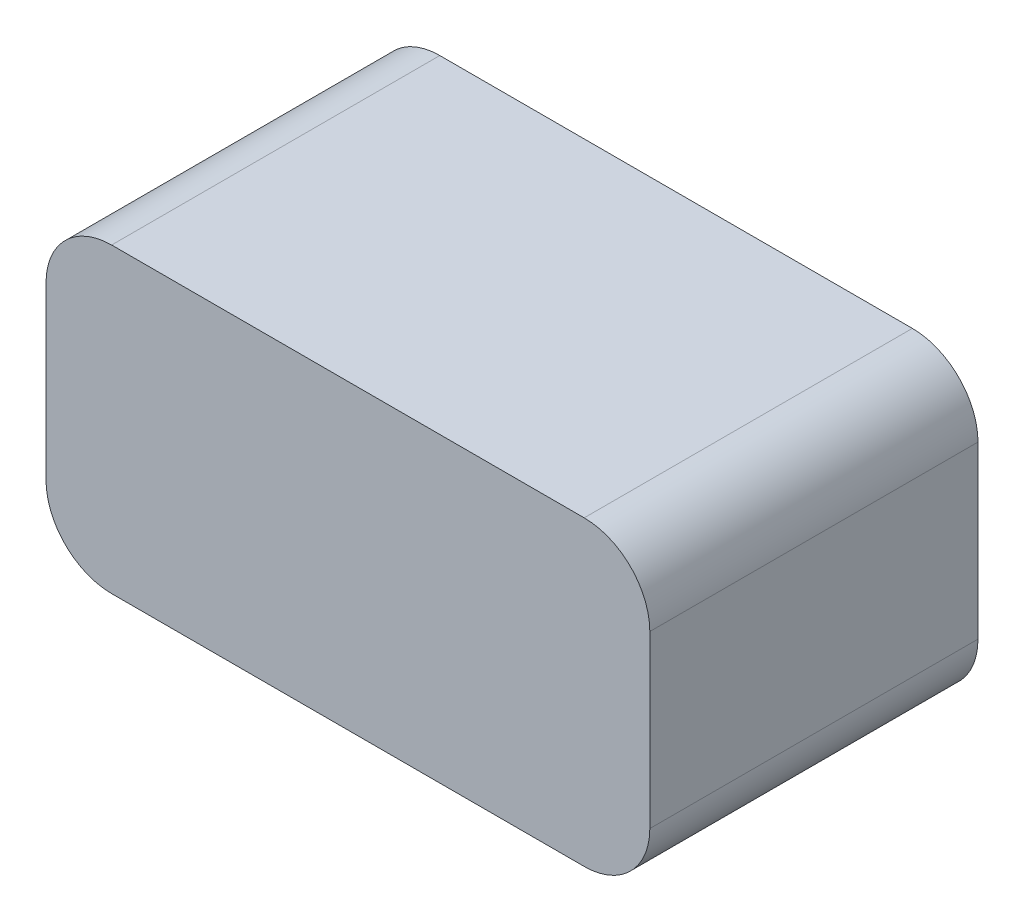
ISO-10303-21;
HEADER;
FILE_DESCRIPTION(('STEP AP214'),'2;1');
FILE_NAME('part.step','',(''),(''),'','','');
FILE_SCHEMA(('AUTOMOTIVE_DESIGN { 1 0 10303 214 1 1 1 1 }'));
ENDSEC;
DATA;
#1=APPLICATION_CONTEXT('core data for automotive mechanical design processes');
#2=APPLICATION_PROTOCOL_DEFINITION('international standard','automotive_design',2000,#1);
#3=PRODUCT_CONTEXT('',#1,'mechanical');
#4=PRODUCT('Part','Part','',(#3));
#5=PRODUCT_RELATED_PRODUCT_CATEGORY('part','',(#4));
#6=PRODUCT_DEFINITION_FORMATION('','',#4);
#7=PRODUCT_DEFINITION_CONTEXT('part definition',#1,'design');
#8=PRODUCT_DEFINITION('design','',#6,#7);
#9=PRODUCT_DEFINITION_SHAPE('','',#8);
#10=(LENGTH_UNIT() NAMED_UNIT(*) SI_UNIT(.MILLI.,.METRE.));
#11=(NAMED_UNIT(*) PLANE_ANGLE_UNIT() SI_UNIT($,.RADIAN.));
#12=(NAMED_UNIT(*) SI_UNIT($,.STERADIAN.) SOLID_ANGLE_UNIT());
#13=UNCERTAINTY_MEASURE_WITH_UNIT(LENGTH_MEASURE(1.E-05),#10,'distance_accuracy_value','');
#14=(GEOMETRIC_REPRESENTATION_CONTEXT(3) GLOBAL_UNCERTAINTY_ASSIGNED_CONTEXT((#13)) GLOBAL_UNIT_ASSIGNED_CONTEXT((#10,
#11,#12)) REPRESENTATION_CONTEXT('',''));
#15=CARTESIAN_POINT('',(0.,0.,0.));
#16=DIRECTION('',(0.,0.,1.));
#17=DIRECTION('',(1.,0.,0.));
#18=AXIS2_PLACEMENT_3D('',#15,#16,#17);
#19=CARTESIAN_POINT('',(0.,23.,0.));
#20=DIRECTION('',(1.,0.,0.));
#21=DIRECTION('',(0.,0.,-1.));
#22=AXIS2_PLACEMENT_3D('',#19,#20,#21);
#23=PLANE('',#22);
#24=DIRECTION('',(0.,-1.,0.));
#25=VECTOR('',#24,1.);
#26=CARTESIAN_POINT('',(0.,23.,-25.));
#27=LINE('',#26,#25);
#28=CARTESIAN_POINT('',(0.,18.,-25.));
#29=VERTEX_POINT('',#28);
#30=CARTESIAN_POINT('',(0.,5.,-25.));
#31=VERTEX_POINT('',#30);
#32=EDGE_CURVE('E191',#29,#31,#27,.T.);
#33=ORIENTED_EDGE('',*,*,#32,.T.);
#34=DIRECTION('',(0.,0.,1.));
#35=VECTOR('',#34,1.);
#36=CARTESIAN_POINT('',(0.,5.,0.));
#37=LINE('',#36,#35);
#38=CARTESIAN_POINT('',(0.,5.,0.));
#39=VERTEX_POINT('',#38);
#40=EDGE_CURVE('E130',#31,#39,#37,.T.);
#41=ORIENTED_EDGE('',*,*,#40,.T.);
#42=DIRECTION('',(0.,-1.,0.));
#43=VECTOR('',#42,1.);
#44=CARTESIAN_POINT('',(0.,23.,0.));
#45=LINE('',#44,#43);
#46=CARTESIAN_POINT('',(0.,18.,0.));
#47=VERTEX_POINT('',#46);
#48=EDGE_CURVE('E113',#47,#39,#45,.T.);
#49=ORIENTED_EDGE('',*,*,#48,.F.);
#50=DIRECTION('',(0.,0.,1.));
#51=VECTOR('',#50,1.);
#52=CARTESIAN_POINT('',(0.,18.,0.));
#53=LINE('',#52,#51);
#54=EDGE_CURVE('E127',#47,#29,#53,.F.);
#55=ORIENTED_EDGE('',*,*,#54,.T.);
#56=EDGE_LOOP('',(#33,#41,#49,#55));
#57=FACE_BOUND('',#56,.T.);
#58=ADVANCED_FACE('F43',(#57),#23,.F.);
#59=CARTESIAN_POINT('',(0.,23.,0.));
#60=DIRECTION('',(0.,0.,-1.));
#61=DIRECTION('',(-1.,0.,0.));
#62=AXIS2_PLACEMENT_3D('',#59,#60,#61);
#63=PLANE('',#62);
#64=ORIENTED_EDGE('',*,*,#48,.T.);
#65=CARTESIAN_POINT('',(5.,5.,0.));
#66=DIRECTION('',(0.,0.,-1.));
#67=DIRECTION('',(-1.,0.,0.));
#68=AXIS2_PLACEMENT_3D('',#65,#66,#67);
#69=CIRCLE('',#68,5.);
#70=CARTESIAN_POINT('',(5.,0.,0.));
#71=VERTEX_POINT('',#70);
#72=EDGE_CURVE('E121',#39,#71,#69,.F.);
#73=ORIENTED_EDGE('',*,*,#72,.T.);
#74=DIRECTION('',(1.,0.,0.));
#75=VECTOR('',#74,1.);
#76=CARTESIAN_POINT('',(0.,0.,0.));
#77=LINE('',#76,#75);
#78=CARTESIAN_POINT('',(41.,0.,0.));
#79=VERTEX_POINT('',#78);
#80=EDGE_CURVE('E199',#71,#79,#77,.T.);
#81=ORIENTED_EDGE('',*,*,#80,.T.);
#82=CARTESIAN_POINT('',(41.,5.,0.));
#83=DIRECTION('',(0.,0.,-1.));
#84=DIRECTION('',(-1.,0.,0.));
#85=AXIS2_PLACEMENT_3D('',#82,#83,#84);
#86=CIRCLE('',#85,5.);
#87=CARTESIAN_POINT('',(46.,5.,0.));
#88=VERTEX_POINT('',#87);
#89=EDGE_CURVE('E122',#79,#88,#86,.F.);
#90=ORIENTED_EDGE('',*,*,#89,.T.);
#91=DIRECTION('',(0.,-1.,0.));
#92=VECTOR('',#91,1.);
#93=CARTESIAN_POINT('',(46.,23.,0.));
#94=LINE('',#93,#92);
#95=CARTESIAN_POINT('',(46.,18.,0.));
#96=VERTEX_POINT('',#95);
#97=EDGE_CURVE('E132',#96,#88,#94,.T.);
#98=ORIENTED_EDGE('',*,*,#97,.F.);
#99=CARTESIAN_POINT('',(41.,18.,0.));
#100=DIRECTION('',(0.,0.,-1.));
#101=DIRECTION('',(-1.,0.,0.));
#102=AXIS2_PLACEMENT_3D('',#99,#100,#101);
#103=CIRCLE('',#102,5.);
#104=CARTESIAN_POINT('',(41.,23.,0.));
#105=VERTEX_POINT('',#104);
#106=EDGE_CURVE('E140',#96,#105,#103,.F.);
#107=ORIENTED_EDGE('',*,*,#106,.T.);
#108=DIRECTION('',(1.,0.,0.));
#109=VECTOR('',#108,1.);
#110=CARTESIAN_POINT('',(0.,23.,0.));
#111=LINE('',#110,#109);
#112=CARTESIAN_POINT('',(5.,23.,0.));
#113=VERTEX_POINT('',#112);
#114=EDGE_CURVE('E115',#113,#105,#111,.T.);
#115=ORIENTED_EDGE('',*,*,#114,.F.);
#116=CARTESIAN_POINT('',(5.,18.,0.));
#117=DIRECTION('',(0.,0.,-1.));
#118=DIRECTION('',(-1.,0.,0.));
#119=AXIS2_PLACEMENT_3D('',#116,#117,#118);
#120=CIRCLE('',#119,5.);
#121=EDGE_CURVE('E110',#113,#47,#120,.F.);
#122=ORIENTED_EDGE('',*,*,#121,.T.);
#123=EDGE_LOOP('',(#64,#73,#81,#90,#98,#107,#115,#122));
#124=FACE_BOUND('',#123,.T.);
#125=ADVANCED_FACE('F112',(#124),#63,.F.);
#126=CARTESIAN_POINT('',(46.,23.,0.));
#127=DIRECTION('',(-1.,0.,0.));
#128=DIRECTION('',(0.,0.,1.));
#129=AXIS2_PLACEMENT_3D('',#126,#127,#128);
#130=PLANE('',#129);
#131=ORIENTED_EDGE('',*,*,#97,.T.);
#132=DIRECTION('',(0.,0.,-1.));
#133=VECTOR('',#132,1.);
#134=CARTESIAN_POINT('',(46.,5.,-25.));
#135=LINE('',#134,#133);
#136=CARTESIAN_POINT('',(46.,5.,-25.));
#137=VERTEX_POINT('',#136);
#138=EDGE_CURVE('E11',#88,#137,#135,.T.);
#139=ORIENTED_EDGE('',*,*,#138,.T.);
#140=DIRECTION('',(0.,-1.,0.));
#141=VECTOR('',#140,1.);
#142=CARTESIAN_POINT('',(46.,23.,-25.));
#143=LINE('',#142,#141);
#144=CARTESIAN_POINT('',(46.,18.,-25.));
#145=VERTEX_POINT('',#144);
#146=EDGE_CURVE('E177',#145,#137,#143,.T.);
#147=ORIENTED_EDGE('',*,*,#146,.F.);
#148=DIRECTION('',(0.,0.,-1.));
#149=VECTOR('',#148,1.);
#150=CARTESIAN_POINT('',(46.,18.,0.));
#151=LINE('',#150,#149);
#152=EDGE_CURVE('E52',#145,#96,#151,.F.);
#153=ORIENTED_EDGE('',*,*,#152,.T.);
#154=EDGE_LOOP('',(#131,#139,#147,#153));
#155=FACE_BOUND('',#154,.T.);
#156=ADVANCED_FACE('F176',(#155),#130,.F.);
#157=CARTESIAN_POINT('',(0.,23.,-25.));
#158=DIRECTION('',(0.,0.,1.));
#159=DIRECTION('',(1.,0.,0.));
#160=AXIS2_PLACEMENT_3D('',#157,#158,#159);
#161=PLANE('',#160);
#162=DIRECTION('',(-1.,0.,0.));
#163=VECTOR('',#162,1.);
#164=CARTESIAN_POINT('',(0.,0.,-25.));
#165=LINE('',#164,#163);
#166=CARTESIAN_POINT('',(41.,0.,-25.));
#167=VERTEX_POINT('',#166);
#168=CARTESIAN_POINT('',(5.,0.,-25.));
#169=VERTEX_POINT('',#168);
#170=EDGE_CURVE('E196',#167,#169,#165,.T.);
#171=ORIENTED_EDGE('',*,*,#170,.T.);
#172=CARTESIAN_POINT('',(5.,5.,-25.));
#173=DIRECTION('',(0.,0.,1.));
#174=DIRECTION('',(1.,0.,0.));
#175=AXIS2_PLACEMENT_3D('',#172,#173,#174);
#176=CIRCLE('',#175,5.);
#177=EDGE_CURVE('E162',#169,#31,#176,.F.);
#178=ORIENTED_EDGE('',*,*,#177,.T.);
#179=ORIENTED_EDGE('',*,*,#32,.F.);
#180=CARTESIAN_POINT('',(5.,18.,-25.));
#181=DIRECTION('',(0.,0.,1.));
#182=DIRECTION('',(1.,0.,0.));
#183=AXIS2_PLACEMENT_3D('',#180,#181,#182);
#184=CIRCLE('',#183,5.);
#185=CARTESIAN_POINT('',(5.,23.,-25.));
#186=VERTEX_POINT('',#185);
#187=EDGE_CURVE('E136',#29,#186,#184,.F.);
#188=ORIENTED_EDGE('',*,*,#187,.T.);
#189=DIRECTION('',(-1.,0.,0.));
#190=VECTOR('',#189,1.);
#191=CARTESIAN_POINT('',(0.,23.,-25.));
#192=LINE('',#191,#190);
#193=CARTESIAN_POINT('',(41.,23.,-25.));
#194=VERTEX_POINT('',#193);
#195=EDGE_CURVE('E187',#194,#186,#192,.T.);
#196=ORIENTED_EDGE('',*,*,#195,.F.);
#197=CARTESIAN_POINT('',(41.,18.,-25.));
#198=DIRECTION('',(0.,0.,1.));
#199=DIRECTION('',(1.,0.,0.));
#200=AXIS2_PLACEMENT_3D('',#197,#198,#199);
#201=CIRCLE('',#200,5.);
#202=EDGE_CURVE('E66',#194,#145,#201,.F.);
#203=ORIENTED_EDGE('',*,*,#202,.T.);
#204=ORIENTED_EDGE('',*,*,#146,.T.);
#205=CARTESIAN_POINT('',(41.,5.,-25.));
#206=DIRECTION('',(0.,0.,1.));
#207=DIRECTION('',(1.,0.,0.));
#208=AXIS2_PLACEMENT_3D('',#205,#206,#207);
#209=CIRCLE('',#208,5.);
#210=EDGE_CURVE('E59',#137,#167,#209,.F.);
#211=ORIENTED_EDGE('',*,*,#210,.T.);
#212=EDGE_LOOP('',(#171,#178,#179,#188,#196,#203,#204,#211));
#213=FACE_BOUND('',#212,.T.);
#214=ADVANCED_FACE('F189',(#213),#161,.F.);
#215=CARTESIAN_POINT('',(0.,23.,0.));
#216=DIRECTION('',(0.,-1.,0.));
#217=DIRECTION('',(0.,0.,-1.));
#218=AXIS2_PLACEMENT_3D('',#215,#216,#217);
#219=PLANE('',#218);
#220=ORIENTED_EDGE('',*,*,#195,.T.);
#221=DIRECTION('',(0.,0.,1.));
#222=VECTOR('',#221,1.);
#223=CARTESIAN_POINT('',(5.,23.,0.));
#224=LINE('',#223,#222);
#225=EDGE_CURVE('E169',#186,#113,#224,.T.);
#226=ORIENTED_EDGE('',*,*,#225,.T.);
#227=ORIENTED_EDGE('',*,*,#114,.T.);
#228=DIRECTION('',(0.,0.,-1.));
#229=VECTOR('',#228,1.);
#230=CARTESIAN_POINT('',(41.,23.,0.));
#231=LINE('',#230,#229);
#232=EDGE_CURVE('E165',#105,#194,#231,.T.);
#233=ORIENTED_EDGE('',*,*,#232,.T.);
#234=EDGE_LOOP('',(#220,#226,#227,#233));
#235=FACE_BOUND('',#234,.T.);
#236=ADVANCED_FACE('F186',(#235),#219,.F.);
#237=CARTESIAN_POINT('',(0.,0.,0.));
#238=DIRECTION('',(0.,-1.,0.));
#239=DIRECTION('',(0.,0.,-1.));
#240=AXIS2_PLACEMENT_3D('',#237,#238,#239);
#241=PLANE('',#240);
#242=ORIENTED_EDGE('',*,*,#80,.F.);
#243=DIRECTION('',(0.,0.,1.));
#244=VECTOR('',#243,1.);
#245=CARTESIAN_POINT('',(5.,0.,-25.));
#246=LINE('',#245,#244);
#247=EDGE_CURVE('E153',#71,#169,#246,.F.);
#248=ORIENTED_EDGE('',*,*,#247,.T.);
#249=ORIENTED_EDGE('',*,*,#170,.F.);
#250=DIRECTION('',(0.,0.,-1.));
#251=VECTOR('',#250,1.);
#252=CARTESIAN_POINT('',(41.,0.,0.));
#253=LINE('',#252,#251);
#254=EDGE_CURVE('E150',#167,#79,#253,.F.);
#255=ORIENTED_EDGE('',*,*,#254,.T.);
#256=EDGE_LOOP('',(#242,#248,#249,#255));
#257=FACE_BOUND('',#256,.T.);
#258=ADVANCED_FACE('F209',(#257),#241,.T.);
#259=CARTESIAN_POINT('',(5.,5.,0.));
#260=DIRECTION('',(0.,0.,-1.));
#261=DIRECTION('',(-1.,0.,0.));
#262=AXIS2_PLACEMENT_3D('',#259,#260,#261);
#263=CYLINDRICAL_SURFACE('',#262,5.);
#264=ORIENTED_EDGE('',*,*,#177,.F.);
#265=ORIENTED_EDGE('',*,*,#247,.F.);
#266=ORIENTED_EDGE('',*,*,#72,.F.);
#267=ORIENTED_EDGE('',*,*,#40,.F.);
#268=EDGE_LOOP('',(#264,#265,#266,#267));
#269=FACE_BOUND('',#268,.T.);
#270=ADVANCED_FACE('F217',(#269),#263,.T.);
#271=CARTESIAN_POINT('',(5.,18.,0.));
#272=DIRECTION('',(0.,0.,1.));
#273=DIRECTION('',(1.,0.,0.));
#274=AXIS2_PLACEMENT_3D('',#271,#272,#273);
#275=CYLINDRICAL_SURFACE('',#274,5.);
#276=ORIENTED_EDGE('',*,*,#187,.F.);
#277=ORIENTED_EDGE('',*,*,#54,.F.);
#278=ORIENTED_EDGE('',*,*,#121,.F.);
#279=ORIENTED_EDGE('',*,*,#225,.F.);
#280=EDGE_LOOP('',(#276,#277,#278,#279));
#281=FACE_BOUND('',#280,.T.);
#282=ADVANCED_FACE('F135',(#281),#275,.T.);
#283=CARTESIAN_POINT('',(41.,5.,0.));
#284=DIRECTION('',(0.,0.,1.));
#285=DIRECTION('',(1.,0.,0.));
#286=AXIS2_PLACEMENT_3D('',#283,#284,#285);
#287=CYLINDRICAL_SURFACE('',#286,5.);
#288=ORIENTED_EDGE('',*,*,#89,.F.);
#289=ORIENTED_EDGE('',*,*,#254,.F.);
#290=ORIENTED_EDGE('',*,*,#210,.F.);
#291=ORIENTED_EDGE('',*,*,#138,.F.);
#292=EDGE_LOOP('',(#288,#289,#290,#291));
#293=FACE_BOUND('',#292,.T.);
#294=ADVANCED_FACE('F211',(#293),#287,.T.);
#295=CARTESIAN_POINT('',(41.,18.,0.));
#296=DIRECTION('',(0.,0.,-1.));
#297=DIRECTION('',(-1.,0.,0.));
#298=AXIS2_PLACEMENT_3D('',#295,#296,#297);
#299=CYLINDRICAL_SURFACE('',#298,5.);
#300=ORIENTED_EDGE('',*,*,#106,.F.);
#301=ORIENTED_EDGE('',*,*,#152,.F.);
#302=ORIENTED_EDGE('',*,*,#202,.F.);
#303=ORIENTED_EDGE('',*,*,#232,.F.);
#304=EDGE_LOOP('',(#300,#301,#302,#303));
#305=FACE_BOUND('',#304,.T.);
#306=ADVANCED_FACE('F45',(#305),#299,.T.);
#307=CLOSED_SHELL('',(#58,#125,#156,#214,#236,#258,#270,#282,#294,#306));
#308=MANIFOLD_SOLID_BREP('B2',#307);
#309=ADVANCED_BREP_SHAPE_REPRESENTATION('',(#18,#308),#14);
#310=SHAPE_DEFINITION_REPRESENTATION(#9,#309);
ENDSEC;
END-ISO-10303-21;
